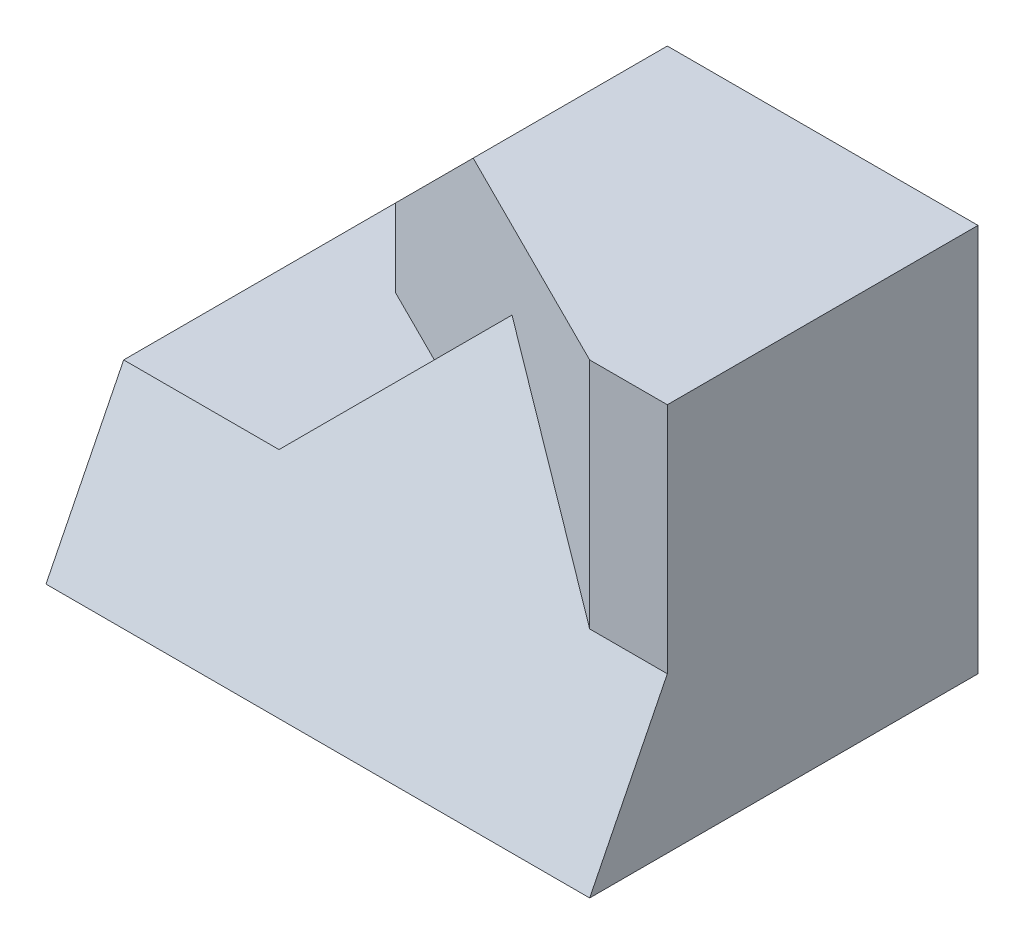
ISO-10303-21;
HEADER;
FILE_DESCRIPTION(('STEP AP214'),'2;1');
FILE_NAME('part.step','',(''),(''),'','','');
FILE_SCHEMA(('AUTOMOTIVE_DESIGN { 1 0 10303 214 1 1 1 1 }'));
ENDSEC;
DATA;
#1=APPLICATION_CONTEXT('core data for automotive mechanical design processes');
#2=APPLICATION_PROTOCOL_DEFINITION('international standard','automotive_design',2000,#1);
#3=PRODUCT_CONTEXT('',#1,'mechanical');
#4=PRODUCT('Part','Part','',(#3));
#5=PRODUCT_RELATED_PRODUCT_CATEGORY('part','',(#4));
#6=PRODUCT_DEFINITION_FORMATION('','',#4);
#7=PRODUCT_DEFINITION_CONTEXT('part definition',#1,'design');
#8=PRODUCT_DEFINITION('design','',#6,#7);
#9=PRODUCT_DEFINITION_SHAPE('','',#8);
#10=(LENGTH_UNIT() NAMED_UNIT(*) SI_UNIT(.MILLI.,.METRE.));
#11=(NAMED_UNIT(*) PLANE_ANGLE_UNIT() SI_UNIT($,.RADIAN.));
#12=(NAMED_UNIT(*) SI_UNIT($,.STERADIAN.) SOLID_ANGLE_UNIT());
#13=UNCERTAINTY_MEASURE_WITH_UNIT(LENGTH_MEASURE(1.E-05),#10,'distance_accuracy_value','');
#14=(GEOMETRIC_REPRESENTATION_CONTEXT(3) GLOBAL_UNCERTAINTY_ASSIGNED_CONTEXT((#13)) GLOBAL_UNIT_ASSIGNED_CONTEXT((#10,
#11,#12)) REPRESENTATION_CONTEXT('',''));
#15=CARTESIAN_POINT('',(0.,0.,0.));
#16=DIRECTION('',(0.,0.,1.));
#17=DIRECTION('',(1.,0.,0.));
#18=AXIS2_PLACEMENT_3D('',#15,#16,#17);
#19=CARTESIAN_POINT('',(-3.,-2.5,4.));
#20=DIRECTION('',(1.,0.,0.));
#21=DIRECTION('',(0.,0.,-1.));
#22=AXIS2_PLACEMENT_3D('',#19,#20,#21);
#23=PLANE('',#22);
#24=DIRECTION('',(0.,0.,-1.));
#25=VECTOR('',#24,1.);
#26=CARTESIAN_POINT('',(-3.,-0.5,4.));
#27=LINE('',#26,#25);
#28=CARTESIAN_POINT('',(-3.,-0.5,1.5));
#29=VERTEX_POINT('',#28);
#30=CARTESIAN_POINT('',(-3.,-0.5,0.));
#31=VERTEX_POINT('',#30);
#32=EDGE_CURVE('E56',#29,#31,#27,.T.);
#33=ORIENTED_EDGE('',*,*,#32,.F.);
#34=DIRECTION('',(0.,1.,0.));
#35=VECTOR('',#34,1.);
#36=CARTESIAN_POINT('',(-3.,-0.5,1.5));
#37=LINE('',#36,#35);
#38=CARTESIAN_POINT('',(-3.,0.5,1.5));
#39=VERTEX_POINT('',#38);
#40=EDGE_CURVE('E132',#29,#39,#37,.T.);
#41=ORIENTED_EDGE('',*,*,#40,.T.);
#42=DIRECTION('',(0.,0.,-1.));
#43=VECTOR('',#42,1.);
#44=CARTESIAN_POINT('',(-3.,0.5,4.));
#45=LINE('',#44,#43);
#46=CARTESIAN_POINT('',(-3.,0.5,0.));
#47=VERTEX_POINT('',#46);
#48=EDGE_CURVE('E150',#39,#47,#45,.T.);
#49=ORIENTED_EDGE('',*,*,#48,.T.);
#50=DIRECTION('',(0.,-1.,0.));
#51=VECTOR('',#50,1.);
#52=CARTESIAN_POINT('',(-3.,-2.5,0.));
#53=LINE('',#52,#51);
#54=EDGE_CURVE('E194',#47,#31,#53,.T.);
#55=ORIENTED_EDGE('',*,*,#54,.T.);
#56=EDGE_LOOP('',(#33,#41,#49,#55));
#57=FACE_BOUND('',#56,.T.);
#58=ADVANCED_FACE('F34',(#57),#23,.F.);
#59=CARTESIAN_POINT('',(0.,0.,4.));
#60=DIRECTION('',(0.,0.,-1.));
#61=DIRECTION('',(-1.,0.,0.));
#62=AXIS2_PLACEMENT_3D('',#59,#60,#61);
#63=PLANE('',#62);
#64=DIRECTION('',(-1.,0.,0.));
#65=VECTOR('',#64,1.);
#66=CARTESIAN_POINT('',(-1.,2.5,4.));
#67=LINE('',#66,#65);
#68=CARTESIAN_POINT('',(3.,2.5,4.));
#69=VERTEX_POINT('',#68);
#70=CARTESIAN_POINT('',(2.,2.5,4.));
#71=VERTEX_POINT('',#70);
#72=EDGE_CURVE('E131',#69,#71,#67,.T.);
#73=ORIENTED_EDGE('',*,*,#72,.T.);
#74=DIRECTION('',(0.,1.,0.));
#75=VECTOR('',#74,1.);
#76=CARTESIAN_POINT('',(2.,-0.5,4.));
#77=LINE('',#76,#75);
#78=CARTESIAN_POINT('',(2.,-0.5,4.));
#79=VERTEX_POINT('',#78);
#80=EDGE_CURVE('E125',#79,#71,#77,.T.);
#81=ORIENTED_EDGE('',*,*,#80,.F.);
#82=DIRECTION('',(-1.,0.,0.));
#83=VECTOR('',#82,1.);
#84=CARTESIAN_POINT('',(0.,-0.5,4.));
#85=LINE('',#84,#83);
#86=CARTESIAN_POINT('',(3.,-0.5,4.));
#87=VERTEX_POINT('',#86);
#88=EDGE_CURVE('E112',#87,#79,#85,.T.);
#89=ORIENTED_EDGE('',*,*,#88,.F.);
#90=DIRECTION('',(0.,1.,0.));
#91=VECTOR('',#90,1.);
#92=CARTESIAN_POINT('',(3.,-2.5,4.));
#93=LINE('',#92,#91);
#94=EDGE_CURVE('E183',#87,#69,#93,.T.);
#95=ORIENTED_EDGE('',*,*,#94,.T.);
#96=EDGE_LOOP('',(#73,#81,#89,#95));
#97=FACE_BOUND('',#96,.T.);
#98=ADVANCED_FACE('F129',(#97),#63,.F.);
#99=CARTESIAN_POINT('',(3.,-2.5,4.));
#100=DIRECTION('',(-1.,0.,0.));
#101=DIRECTION('',(0.,0.,1.));
#102=AXIS2_PLACEMENT_3D('',#99,#100,#101);
#103=PLANE('',#102);
#104=ORIENTED_EDGE('',*,*,#94,.F.);
#105=DIRECTION('',(0.,-0.894427190999916,0.447213595499958));
#106=VECTOR('',#105,1.);
#107=CARTESIAN_POINT('',(3.,-2.1,4.8));
#108=LINE('',#107,#106);
#109=CARTESIAN_POINT('',(3.,-2.5,5.));
#110=VERTEX_POINT('',#109);
#111=EDGE_CURVE('E116',#87,#110,#108,.T.);
#112=ORIENTED_EDGE('',*,*,#111,.T.);
#113=DIRECTION('',(0.,0.,-1.));
#114=VECTOR('',#113,1.);
#115=CARTESIAN_POINT('',(3.,-2.5,4.));
#116=LINE('',#115,#114);
#117=CARTESIAN_POINT('',(3.,-2.5,0.));
#118=VERTEX_POINT('',#117);
#119=EDGE_CURVE('E187',#110,#118,#116,.T.);
#120=ORIENTED_EDGE('',*,*,#119,.T.);
#121=DIRECTION('',(0.,1.,0.));
#122=VECTOR('',#121,1.);
#123=CARTESIAN_POINT('',(3.,-2.5,0.));
#124=LINE('',#123,#122);
#125=CARTESIAN_POINT('',(3.,2.5,0.));
#126=VERTEX_POINT('',#125);
#127=EDGE_CURVE('E182',#118,#126,#124,.T.);
#128=ORIENTED_EDGE('',*,*,#127,.T.);
#129=DIRECTION('',(0.,0.,-1.));
#130=VECTOR('',#129,1.);
#131=CARTESIAN_POINT('',(3.,2.5,4.));
#132=LINE('',#131,#130);
#133=EDGE_CURVE('E143',#69,#126,#132,.T.);
#134=ORIENTED_EDGE('',*,*,#133,.F.);
#135=EDGE_LOOP('',(#104,#112,#120,#128,#134));
#136=FACE_BOUND('',#135,.T.);
#137=ADVANCED_FACE('F36',(#136),#103,.F.);
#138=CARTESIAN_POINT('',(-1.,2.5,4.));
#139=DIRECTION('',(0.,-1.,0.));
#140=DIRECTION('',(0.,0.,-1.));
#141=AXIS2_PLACEMENT_3D('',#138,#139,#140);
#142=PLANE('',#141);
#143=DIRECTION('',(0.,0.,-1.));
#144=VECTOR('',#143,1.);
#145=CARTESIAN_POINT('',(-1.,2.5,4.));
#146=LINE('',#145,#144);
#147=CARTESIAN_POINT('',(-1.,2.5,2.5));
#148=VERTEX_POINT('',#147);
#149=CARTESIAN_POINT('',(-1.,2.5,0.));
#150=VERTEX_POINT('',#149);
#151=EDGE_CURVE('E145',#148,#150,#146,.T.);
#152=ORIENTED_EDGE('',*,*,#151,.F.);
#153=DIRECTION('',(-0.894427190999916,0.,-0.447213595499958));
#154=VECTOR('',#153,1.);
#155=CARTESIAN_POINT('',(2.,2.5,4.));
#156=LINE('',#155,#154);
#157=EDGE_CURVE('E137',#71,#148,#156,.T.);
#158=ORIENTED_EDGE('',*,*,#157,.F.);
#159=ORIENTED_EDGE('',*,*,#72,.F.);
#160=ORIENTED_EDGE('',*,*,#133,.T.);
#161=DIRECTION('',(-1.,0.,0.));
#162=VECTOR('',#161,1.);
#163=CARTESIAN_POINT('',(-1.,2.5,0.));
#164=LINE('',#163,#162);
#165=EDGE_CURVE('E189',#126,#150,#164,.T.);
#166=ORIENTED_EDGE('',*,*,#165,.T.);
#167=EDGE_LOOP('',(#152,#158,#159,#160,#166));
#168=FACE_BOUND('',#167,.T.);
#169=ADVANCED_FACE('F222',(#168),#142,.F.);
#170=CARTESIAN_POINT('',(-3.,0.5,4.));
#171=DIRECTION('',(0.707106781186547,-0.707106781186547,0.));
#172=DIRECTION('',(0.707106781186548,0.707106781186548,0.));
#173=AXIS2_PLACEMENT_3D('',#170,#171,#172);
#174=PLANE('',#173);
#175=ORIENTED_EDGE('',*,*,#48,.F.);
#176=DIRECTION('',(0.666666666666667,0.666666666666667,0.333333333333333));
#177=VECTOR('',#176,1.);
#178=CARTESIAN_POINT('',(-2.44444444444444,1.05555555555556,1.77777777777778));
#179=LINE('',#178,#177);
#180=EDGE_CURVE('E135',#39,#148,#179,.T.);
#181=ORIENTED_EDGE('',*,*,#180,.T.);
#182=ORIENTED_EDGE('',*,*,#151,.T.);
#183=DIRECTION('',(-0.707106781186548,-0.707106781186548,0.));
#184=VECTOR('',#183,1.);
#185=CARTESIAN_POINT('',(-3.,0.5,0.));
#186=LINE('',#185,#184);
#187=EDGE_CURVE('E191',#150,#47,#186,.T.);
#188=ORIENTED_EDGE('',*,*,#187,.T.);
#189=EDGE_LOOP('',(#175,#181,#182,#188));
#190=FACE_BOUND('',#189,.T.);
#191=ADVANCED_FACE('F203',(#190),#174,.F.);
#192=CARTESIAN_POINT('',(-3.,-2.5,4.));
#193=DIRECTION('',(0.,1.,0.));
#194=DIRECTION('',(0.,0.,1.));
#195=AXIS2_PLACEMENT_3D('',#192,#193,#194);
#196=PLANE('',#195);
#197=DIRECTION('',(0.,0.,-1.));
#198=VECTOR('',#197,1.);
#199=CARTESIAN_POINT('',(-4.,-2.5,0.));
#200=LINE('',#199,#198);
#201=CARTESIAN_POINT('',(-4.,-2.5,5.));
#202=VERTEX_POINT('',#201);
#203=CARTESIAN_POINT('',(-4.,-2.5,0.));
#204=VERTEX_POINT('',#203);
#205=EDGE_CURVE('E172',#202,#204,#200,.T.);
#206=ORIENTED_EDGE('',*,*,#205,.T.);
#207=DIRECTION('',(1.,0.,0.));
#208=VECTOR('',#207,1.);
#209=CARTESIAN_POINT('',(-3.,-2.5,0.));
#210=LINE('',#209,#208);
#211=EDGE_CURVE('E185',#204,#118,#210,.T.);
#212=ORIENTED_EDGE('',*,*,#211,.T.);
#213=ORIENTED_EDGE('',*,*,#119,.F.);
#214=DIRECTION('',(-1.,0.,0.));
#215=VECTOR('',#214,1.);
#216=CARTESIAN_POINT('',(3.,-2.5,5.));
#217=LINE('',#216,#215);
#218=EDGE_CURVE('E168',#110,#202,#217,.T.);
#219=ORIENTED_EDGE('',*,*,#218,.T.);
#220=EDGE_LOOP('',(#206,#212,#213,#219));
#221=FACE_BOUND('',#220,.T.);
#222=ADVANCED_FACE('F227',(#221),#196,.F.);
#223=CARTESIAN_POINT('',(0.,0.,0.));
#224=DIRECTION('',(0.,0.,-1.));
#225=DIRECTION('',(-1.,0.,0.));
#226=AXIS2_PLACEMENT_3D('',#223,#224,#225);
#227=PLANE('',#226);
#228=ORIENTED_EDGE('',*,*,#165,.F.);
#229=ORIENTED_EDGE('',*,*,#127,.F.);
#230=ORIENTED_EDGE('',*,*,#211,.F.);
#231=DIRECTION('',(0.,-1.,0.));
#232=VECTOR('',#231,1.);
#233=CARTESIAN_POINT('',(-4.,-0.5,0.));
#234=LINE('',#233,#232);
#235=CARTESIAN_POINT('',(-4.,-0.5,0.));
#236=VERTEX_POINT('',#235);
#237=EDGE_CURVE('E120',#236,#204,#234,.T.);
#238=ORIENTED_EDGE('',*,*,#237,.F.);
#239=DIRECTION('',(1.,0.,0.));
#240=VECTOR('',#239,1.);
#241=CARTESIAN_POINT('',(3.,-0.5,0.));
#242=LINE('',#241,#240);
#243=EDGE_CURVE('E171',#236,#31,#242,.T.);
#244=ORIENTED_EDGE('',*,*,#243,.T.);
#245=ORIENTED_EDGE('',*,*,#54,.F.);
#246=ORIENTED_EDGE('',*,*,#187,.F.);
#247=EDGE_LOOP('',(#228,#229,#230,#238,#244,#245,#246));
#248=FACE_BOUND('',#247,.T.);
#249=ADVANCED_FACE('F207',(#248),#227,.T.);
#250=CARTESIAN_POINT('',(0.,-0.5,0.));
#251=DIRECTION('',(0.,-1.,0.));
#252=DIRECTION('',(0.,0.,-1.));
#253=AXIS2_PLACEMENT_3D('',#250,#251,#252);
#254=PLANE('',#253);
#255=DIRECTION('',(0.,0.,-1.));
#256=VECTOR('',#255,1.);
#257=CARTESIAN_POINT('',(-4.,-0.5,0.));
#258=LINE('',#257,#256);
#259=CARTESIAN_POINT('',(-4.,-0.5,4.));
#260=VERTEX_POINT('',#259);
#261=EDGE_CURVE('E169',#260,#236,#258,.T.);
#262=ORIENTED_EDGE('',*,*,#261,.F.);
#263=DIRECTION('',(-1.,0.,0.));
#264=VECTOR('',#263,1.);
#265=CARTESIAN_POINT('',(11.,-0.5,4.));
#266=LINE('',#265,#264);
#267=CARTESIAN_POINT('',(-2.,-0.5,4.));
#268=VERTEX_POINT('',#267);
#269=EDGE_CURVE('E154',#268,#260,#266,.T.);
#270=ORIENTED_EDGE('',*,*,#269,.F.);
#271=DIRECTION('',(0.,0.,-1.));
#272=VECTOR('',#271,1.);
#273=CARTESIAN_POINT('',(-2.,-0.5,5.));
#274=LINE('',#273,#272);
#275=CARTESIAN_POINT('',(-2.,-0.5,2.));
#276=VERTEX_POINT('',#275);
#277=EDGE_CURVE('E158',#268,#276,#274,.T.);
#278=ORIENTED_EDGE('',*,*,#277,.T.);
#279=DIRECTION('',(-0.894427190999916,0.,-0.447213595499958));
#280=VECTOR('',#279,1.);
#281=CARTESIAN_POINT('',(2.,-0.5,4.));
#282=LINE('',#281,#280);
#283=EDGE_CURVE('E51',#276,#29,#282,.T.);
#284=ORIENTED_EDGE('',*,*,#283,.T.);
#285=ORIENTED_EDGE('',*,*,#32,.T.);
#286=ORIENTED_EDGE('',*,*,#243,.F.);
#287=EDGE_LOOP('',(#262,#270,#278,#284,#285,#286));
#288=FACE_BOUND('',#287,.T.);
#289=ADVANCED_FACE('F210',(#288),#254,.F.);
#290=CARTESIAN_POINT('',(-4.,-0.5,0.));
#291=DIRECTION('',(-1.,0.,0.));
#292=DIRECTION('',(0.,0.,1.));
#293=AXIS2_PLACEMENT_3D('',#290,#291,#292);
#294=PLANE('',#293);
#295=DIRECTION('',(0.,-0.894427190999916,0.447213595499958));
#296=VECTOR('',#295,1.);
#297=CARTESIAN_POINT('',(-4.,-2.5,5.));
#298=LINE('',#297,#296);
#299=EDGE_CURVE('E157',#260,#202,#298,.T.);
#300=ORIENTED_EDGE('',*,*,#299,.F.);
#301=ORIENTED_EDGE('',*,*,#261,.T.);
#302=ORIENTED_EDGE('',*,*,#237,.T.);
#303=ORIENTED_EDGE('',*,*,#205,.F.);
#304=EDGE_LOOP('',(#300,#301,#302,#303));
#305=FACE_BOUND('',#304,.T.);
#306=ADVANCED_FACE('F215',(#305),#294,.T.);
#307=CARTESIAN_POINT('',(2.,-0.5,4.));
#308=DIRECTION('',(0.447213595499958,0.,-0.894427190999916));
#309=DIRECTION('',(-0.894427190999916,0.,-0.447213595499958));
#310=AXIS2_PLACEMENT_3D('',#307,#308,#309);
#311=PLANE('',#310);
#312=DIRECTION('',(0.666666666666667,0.666666666666667,0.333333333333333));
#313=VECTOR('',#312,1.);
#314=CARTESIAN_POINT('',(0.222222222222222,1.72222222222222,3.11111111111111));
#315=LINE('',#314,#313);
#316=CARTESIAN_POINT('',(0.,1.5,3.));
#317=VERTEX_POINT('',#316);
#318=EDGE_CURVE('E43',#276,#317,#315,.T.);
#319=ORIENTED_EDGE('',*,*,#318,.T.);
#320=DIRECTION('',(0.666666666666667,-0.666666666666667,0.333333333333333));
#321=VECTOR('',#320,1.);
#322=CARTESIAN_POINT('',(2.,-0.5,4.));
#323=LINE('',#322,#321);
#324=EDGE_CURVE('E12',#317,#79,#323,.T.);
#325=ORIENTED_EDGE('',*,*,#324,.T.);
#326=ORIENTED_EDGE('',*,*,#80,.T.);
#327=ORIENTED_EDGE('',*,*,#157,.T.);
#328=ORIENTED_EDGE('',*,*,#180,.F.);
#329=ORIENTED_EDGE('',*,*,#40,.F.);
#330=ORIENTED_EDGE('',*,*,#283,.F.);
#331=EDGE_LOOP('',(#319,#325,#326,#327,#328,#329,#330));
#332=FACE_BOUND('',#331,.T.);
#333=ADVANCED_FACE('F124',(#332),#311,.F.);
#334=CARTESIAN_POINT('',(0.,1.5,5.));
#335=DIRECTION('',(-0.707106781186547,0.707106781186548,0.));
#336=DIRECTION('',(-0.707106781186548,-0.707106781186547,0.));
#337=AXIS2_PLACEMENT_3D('',#334,#335,#336);
#338=PLANE('',#337);
#339=DIRECTION('',(0.666666666666667,0.666666666666667,-0.333333333333333));
#340=VECTOR('',#339,1.);
#341=CARTESIAN_POINT('',(-2.,-0.5,4.));
#342=LINE('',#341,#340);
#343=EDGE_CURVE('E217',#268,#317,#342,.T.);
#344=ORIENTED_EDGE('',*,*,#343,.T.);
#345=ORIENTED_EDGE('',*,*,#318,.F.);
#346=ORIENTED_EDGE('',*,*,#277,.F.);
#347=EDGE_LOOP('',(#344,#345,#346));
#348=FACE_BOUND('',#347,.T.);
#349=ADVANCED_FACE('F221',(#348),#338,.T.);
#350=CARTESIAN_POINT('',(11.,-2.5,5.));
#351=DIRECTION('',(0.,-0.447213595499958,-0.894427190999916));
#352=DIRECTION('',(0.,0.894427190999916,-0.447213595499958));
#353=AXIS2_PLACEMENT_3D('',#350,#351,#352);
#354=PLANE('',#353);
#355=ORIENTED_EDGE('',*,*,#88,.T.);
#356=ORIENTED_EDGE('',*,*,#324,.F.);
#357=ORIENTED_EDGE('',*,*,#343,.F.);
#358=ORIENTED_EDGE('',*,*,#269,.T.);
#359=ORIENTED_EDGE('',*,*,#299,.T.);
#360=ORIENTED_EDGE('',*,*,#218,.F.);
#361=ORIENTED_EDGE('',*,*,#111,.F.);
#362=EDGE_LOOP('',(#355,#356,#357,#358,#359,#360,#361));
#363=FACE_BOUND('',#362,.T.);
#364=ADVANCED_FACE('F113',(#363),#354,.F.);
#365=CLOSED_SHELL('',(#58,#98,#137,#169,#191,#222,#249,#289,#306,#333,#349,#364));
#366=MANIFOLD_SOLID_BREP('B2',#365);
#367=ADVANCED_BREP_SHAPE_REPRESENTATION('',(#18,#366),#14);
#368=SHAPE_DEFINITION_REPRESENTATION(#9,#367);
ENDSEC;
END-ISO-10303-21;
